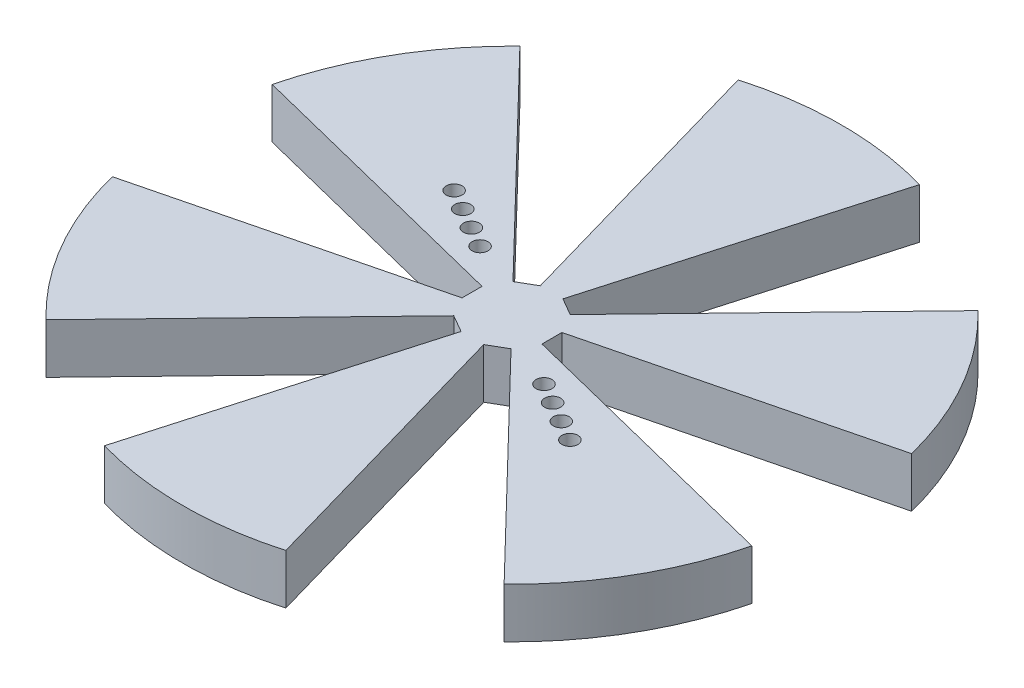
ISO-10303-21;
HEADER;
FILE_DESCRIPTION(('STEP AP214'),'2;1');
FILE_NAME('part.step','',(''),(''),'','','');
FILE_SCHEMA(('AUTOMOTIVE_DESIGN { 1 0 10303 214 1 1 1 1 }'));
ENDSEC;
DATA;
#1=APPLICATION_CONTEXT('core data for automotive mechanical design processes');
#2=APPLICATION_PROTOCOL_DEFINITION('international standard','automotive_design',2000,#1);
#3=PRODUCT_CONTEXT('',#1,'mechanical');
#4=PRODUCT('Part','Part','',(#3));
#5=PRODUCT_RELATED_PRODUCT_CATEGORY('part','',(#4));
#6=PRODUCT_DEFINITION_FORMATION('','',#4);
#7=PRODUCT_DEFINITION_CONTEXT('part definition',#1,'design');
#8=PRODUCT_DEFINITION('design','',#6,#7);
#9=PRODUCT_DEFINITION_SHAPE('','',#8);
#10=(LENGTH_UNIT() NAMED_UNIT(*) SI_UNIT(.MILLI.,.METRE.));
#11=(NAMED_UNIT(*) PLANE_ANGLE_UNIT() SI_UNIT($,.RADIAN.));
#12=(NAMED_UNIT(*) SI_UNIT($,.STERADIAN.) SOLID_ANGLE_UNIT());
#13=UNCERTAINTY_MEASURE_WITH_UNIT(LENGTH_MEASURE(1.E-05),#10,'distance_accuracy_value','');
#14=(GEOMETRIC_REPRESENTATION_CONTEXT(3) GLOBAL_UNCERTAINTY_ASSIGNED_CONTEXT((#13)) GLOBAL_UNIT_ASSIGNED_CONTEXT((#10,
#11,#12)) REPRESENTATION_CONTEXT('',''));
#15=CARTESIAN_POINT('',(0.,0.,0.));
#16=DIRECTION('',(0.,0.,1.));
#17=DIRECTION('',(1.,0.,0.));
#18=AXIS2_PLACEMENT_3D('',#15,#16,#17);
#19=CARTESIAN_POINT('',(0.,6.35,0.));
#20=DIRECTION('',(0.,-1.,0.));
#21=DIRECTION('',(0.,0.,-1.));
#22=AXIS2_PLACEMENT_3D('',#19,#20,#21);
#23=CYLINDRICAL_SURFACE('',#22,41.91);
#24=DIRECTION('',(0.,1.,0.));
#25=VECTOR('',#24,1.);
#26=CARTESIAN_POINT('',(-11.5311013513994,0.,40.2924534078499));
#27=LINE('',#26,#25);
#28=CARTESIAN_POINT('',(-11.5311013513994,0.,40.2924534078499));
#29=VERTEX_POINT('',#28);
#30=CARTESIAN_POINT('',(-11.5311013513994,6.35,40.2924534078499));
#31=VERTEX_POINT('',#30);
#32=EDGE_CURVE('E319',#29,#31,#27,.T.);
#33=ORIENTED_EDGE('',*,*,#32,.F.);
#34=CARTESIAN_POINT('',(0.,0.,0.));
#35=DIRECTION('',(0.,1.,0.));
#36=DIRECTION('',(0.,0.,1.));
#37=AXIS2_PLACEMENT_3D('',#34,#35,#36);
#38=CIRCLE('',#37,41.91);
#39=CARTESIAN_POINT('',(11.5311013513994,0.,40.2924534078499));
#40=VERTEX_POINT('',#39);
#41=EDGE_CURVE('E312',#29,#40,#38,.T.);
#42=ORIENTED_EDGE('',*,*,#41,.T.);
#43=DIRECTION('',(0.,1.,0.));
#44=VECTOR('',#43,1.);
#45=CARTESIAN_POINT('',(11.5311013513994,0.,40.2924534078499));
#46=LINE('',#45,#44);
#47=CARTESIAN_POINT('',(11.5311013513994,6.35,40.2924534078499));
#48=VERTEX_POINT('',#47);
#49=EDGE_CURVE('E292',#40,#48,#46,.T.);
#50=ORIENTED_EDGE('',*,*,#49,.T.);
#51=CARTESIAN_POINT('',(0.,6.35,0.));
#52=DIRECTION('',(0.,1.,0.));
#53=DIRECTION('',(0.,0.,1.));
#54=AXIS2_PLACEMENT_3D('',#51,#52,#53);
#55=CIRCLE('',#54,41.91);
#56=EDGE_CURVE('E613',#31,#48,#55,.T.);
#57=ORIENTED_EDGE('',*,*,#56,.F.);
#58=EDGE_LOOP('',(#33,#42,#50,#57));
#59=FACE_BOUND('',#58,.T.);
#60=ADVANCED_FACE('F129',(#59),#23,.T.);
#61=DIRECTION('',(0.,1.,0.));
#62=VECTOR('',#61,1.);
#63=CARTESIAN_POINT('',(-29.1287375562992,0.,30.1324534078499));
#64=LINE('',#63,#62);
#65=CARTESIAN_POINT('',(-29.1287375562992,0.,30.1324534078499));
#66=VERTEX_POINT('',#65);
#67=CARTESIAN_POINT('',(-29.1287375562992,6.35,30.1324534078499));
#68=VERTEX_POINT('',#67);
#69=EDGE_CURVE('E432',#66,#68,#64,.T.);
#70=ORIENTED_EDGE('',*,*,#69,.T.);
#71=CARTESIAN_POINT('',(-40.6598389076986,6.35,10.16));
#72=VERTEX_POINT('',#71);
#73=EDGE_CURVE('E137',#72,#68,#55,.T.);
#74=ORIENTED_EDGE('',*,*,#73,.F.);
#75=DIRECTION('',(0.,1.,0.));
#76=VECTOR('',#75,1.);
#77=CARTESIAN_POINT('',(-40.6598389076986,0.,10.16));
#78=LINE('',#77,#76);
#79=CARTESIAN_POINT('',(-40.6598389076986,0.,10.16));
#80=VERTEX_POINT('',#79);
#81=EDGE_CURVE('E445',#80,#72,#78,.T.);
#82=ORIENTED_EDGE('',*,*,#81,.F.);
#83=EDGE_CURVE('E320',#80,#66,#38,.T.);
#84=ORIENTED_EDGE('',*,*,#83,.T.);
#85=EDGE_LOOP('',(#70,#74,#82,#84));
#86=FACE_BOUND('',#85,.T.);
#87=ADVANCED_FACE('F560',(#86),#23,.T.);
#88=DIRECTION('',(0.,1.,0.));
#89=VECTOR('',#88,1.);
#90=CARTESIAN_POINT('',(-40.6598389076986,0.,-10.16));
#91=LINE('',#90,#89);
#92=CARTESIAN_POINT('',(-40.6598389076986,0.,-10.16));
#93=VERTEX_POINT('',#92);
#94=CARTESIAN_POINT('',(-40.6598389076986,6.35,-10.16));
#95=VERTEX_POINT('',#94);
#96=EDGE_CURVE('E455',#93,#95,#91,.T.);
#97=ORIENTED_EDGE('',*,*,#96,.T.);
#98=CARTESIAN_POINT('',(-29.1287375562992,6.35,-30.1324534078499));
#99=VERTEX_POINT('',#98);
#100=EDGE_CURVE('E12',#99,#95,#55,.T.);
#101=ORIENTED_EDGE('',*,*,#100,.F.);
#102=DIRECTION('',(0.,1.,0.));
#103=VECTOR('',#102,1.);
#104=CARTESIAN_POINT('',(-29.1287375562992,0.,-30.1324534078499));
#105=LINE('',#104,#103);
#106=CARTESIAN_POINT('',(-29.1287375562992,0.,-30.1324534078499));
#107=VERTEX_POINT('',#106);
#108=EDGE_CURVE('E335',#107,#99,#105,.T.);
#109=ORIENTED_EDGE('',*,*,#108,.F.);
#110=EDGE_CURVE('E132',#107,#93,#38,.T.);
#111=ORIENTED_EDGE('',*,*,#110,.T.);
#112=EDGE_LOOP('',(#97,#101,#109,#111));
#113=FACE_BOUND('',#112,.T.);
#114=ADVANCED_FACE('F572',(#113),#23,.T.);
#115=DIRECTION('',(0.,1.,0.));
#116=VECTOR('',#115,1.);
#117=CARTESIAN_POINT('',(29.1287375562992,0.,30.1324534078499));
#118=LINE('',#117,#116);
#119=CARTESIAN_POINT('',(29.1287375562992,0.,30.1324534078499));
#120=VERTEX_POINT('',#119);
#121=CARTESIAN_POINT('',(29.1287375562992,6.35,30.1324534078499));
#122=VERTEX_POINT('',#121);
#123=EDGE_CURVE('E304',#120,#122,#118,.T.);
#124=ORIENTED_EDGE('',*,*,#123,.F.);
#125=CARTESIAN_POINT('',(40.6598389076986,0.,10.16));
#126=VERTEX_POINT('',#125);
#127=EDGE_CURVE('E321',#120,#126,#38,.T.);
#128=ORIENTED_EDGE('',*,*,#127,.T.);
#129=DIRECTION('',(0.,1.,0.));
#130=VECTOR('',#129,1.);
#131=CARTESIAN_POINT('',(40.6598389076986,0.,10.16));
#132=LINE('',#131,#130);
#133=CARTESIAN_POINT('',(40.6598389076986,6.35,10.16));
#134=VERTEX_POINT('',#133);
#135=EDGE_CURVE('E408',#126,#134,#132,.T.);
#136=ORIENTED_EDGE('',*,*,#135,.T.);
#137=EDGE_CURVE('E355',#122,#134,#55,.T.);
#138=ORIENTED_EDGE('',*,*,#137,.F.);
#139=EDGE_LOOP('',(#124,#128,#136,#138));
#140=FACE_BOUND('',#139,.T.);
#141=ADVANCED_FACE('F612',(#140),#23,.T.);
#142=DIRECTION('',(0.,1.,0.));
#143=VECTOR('',#142,1.);
#144=CARTESIAN_POINT('',(11.5311013513994,0.,-40.2924534078499));
#145=LINE('',#144,#143);
#146=CARTESIAN_POINT('',(11.5311013513994,0.,-40.2924534078499));
#147=VERTEX_POINT('',#146);
#148=CARTESIAN_POINT('',(11.5311013513994,6.35,-40.2924534078499));
#149=VERTEX_POINT('',#148);
#150=EDGE_CURVE('E372',#147,#149,#145,.T.);
#151=ORIENTED_EDGE('',*,*,#150,.F.);
#152=CARTESIAN_POINT('',(-11.5311013513994,0.,-40.2924534078499));
#153=VERTEX_POINT('',#152);
#154=EDGE_CURVE('E330',#147,#153,#38,.T.);
#155=ORIENTED_EDGE('',*,*,#154,.T.);
#156=DIRECTION('',(0.,1.,0.));
#157=VECTOR('',#156,1.);
#158=CARTESIAN_POINT('',(-11.5311013513994,0.,-40.2924534078499));
#159=LINE('',#158,#157);
#160=CARTESIAN_POINT('',(-11.5311013513994,6.35,-40.2924534078499));
#161=VERTEX_POINT('',#160);
#162=EDGE_CURVE('E341',#153,#161,#159,.T.);
#163=ORIENTED_EDGE('',*,*,#162,.T.);
#164=EDGE_CURVE('E138',#149,#161,#55,.T.);
#165=ORIENTED_EDGE('',*,*,#164,.F.);
#166=EDGE_LOOP('',(#151,#155,#163,#165));
#167=FACE_BOUND('',#166,.T.);
#168=ADVANCED_FACE('F583',(#167),#23,.T.);
#169=DIRECTION('',(0.,1.,0.));
#170=VECTOR('',#169,1.);
#171=CARTESIAN_POINT('',(29.1287375562992,0.,-30.1324534078499));
#172=LINE('',#171,#170);
#173=CARTESIAN_POINT('',(29.1287375562992,0.,-30.1324534078499));
#174=VERTEX_POINT('',#173);
#175=CARTESIAN_POINT('',(29.1287375562992,6.35,-30.1324534078499));
#176=VERTEX_POINT('',#175);
#177=EDGE_CURVE('E384',#174,#176,#172,.T.);
#178=ORIENTED_EDGE('',*,*,#177,.T.);
#179=CARTESIAN_POINT('',(40.6598389076986,6.35,-10.16));
#180=VERTEX_POINT('',#179);
#181=EDGE_CURVE('E348',#180,#176,#55,.T.);
#182=ORIENTED_EDGE('',*,*,#181,.F.);
#183=DIRECTION('',(0.,1.,0.));
#184=VECTOR('',#183,1.);
#185=CARTESIAN_POINT('',(40.6598389076986,0.,-10.16));
#186=LINE('',#185,#184);
#187=CARTESIAN_POINT('',(40.6598389076986,0.,-10.16));
#188=VERTEX_POINT('',#187);
#189=EDGE_CURVE('E396',#188,#180,#186,.T.);
#190=ORIENTED_EDGE('',*,*,#189,.F.);
#191=EDGE_CURVE('E324',#188,#174,#38,.T.);
#192=ORIENTED_EDGE('',*,*,#191,.T.);
#193=EDGE_LOOP('',(#178,#182,#190,#192));
#194=FACE_BOUND('',#193,.T.);
#195=ADVANCED_FACE('F538',(#194),#23,.T.);
#196=CARTESIAN_POINT('',(0.,6.35,0.));
#197=DIRECTION('',(0.,1.,0.));
#198=DIRECTION('',(0.,0.,1.));
#199=AXIS2_PLACEMENT_3D('',#196,#197,#198);
#200=PLANE('',#199);
#201=CARTESIAN_POINT('',(-14.8198597222612,6.35,-8.55624999999999));
#202=DIRECTION('',(0.,1.,0.));
#203=DIRECTION('',(0.,0.,1.));
#204=AXIS2_PLACEMENT_3D('',#201,#202,#203);
#205=CIRCLE('',#204,1.016);
#206=CARTESIAN_POINT('',(-14.8198597222612,6.35,-7.54024999999999));
#207=VERTEX_POINT('',#206);
#208=EDGE_CURVE('E495',#207,#207,#205,.T.);
#209=ORIENTED_EDGE('',*,*,#208,.F.);
#210=EDGE_LOOP('',(#209));
#211=FACE_BOUND('',#210,.T.);
#212=CARTESIAN_POINT('',(-17.4179359336145,6.35,-10.05625));
#213=DIRECTION('',(0.,1.,0.));
#214=DIRECTION('',(0.,0.,1.));
#215=AXIS2_PLACEMENT_3D('',#212,#213,#214);
#216=CIRCLE('',#215,1.016);
#217=CARTESIAN_POINT('',(-17.4179359336145,6.35,-9.04024999999999));
#218=VERTEX_POINT('',#217);
#219=EDGE_CURVE('E513',#218,#218,#216,.T.);
#220=ORIENTED_EDGE('',*,*,#219,.F.);
#221=EDGE_LOOP('',(#220));
#222=FACE_BOUND('',#221,.T.);
#223=CARTESIAN_POINT('',(-12.2217835109079,6.35,-7.05624999999999));
#224=DIRECTION('',(0.,1.,0.));
#225=DIRECTION('',(0.,0.,1.));
#226=AXIS2_PLACEMENT_3D('',#223,#224,#225);
#227=CIRCLE('',#226,1.016);
#228=CARTESIAN_POINT('',(-12.2217835109079,6.35,-6.04024999999999));
#229=VERTEX_POINT('',#228);
#230=EDGE_CURVE('E506',#229,#229,#227,.T.);
#231=ORIENTED_EDGE('',*,*,#230,.F.);
#232=EDGE_LOOP('',(#231));
#233=FACE_BOUND('',#232,.T.);
#234=CARTESIAN_POINT('',(12.2217835109079,6.35,7.05625));
#235=DIRECTION('',(0.,1.,0.));
#236=DIRECTION('',(0.,0.,1.));
#237=AXIS2_PLACEMENT_3D('',#234,#235,#236);
#238=CIRCLE('',#237,1.016);
#239=CARTESIAN_POINT('',(12.2217835109079,6.35,8.07225));
#240=VERTEX_POINT('',#239);
#241=EDGE_CURVE('E507',#240,#240,#238,.T.);
#242=ORIENTED_EDGE('',*,*,#241,.F.);
#243=EDGE_LOOP('',(#242));
#244=FACE_BOUND('',#243,.T.);
#245=CARTESIAN_POINT('',(14.8198597222612,6.35,8.55624999999999));
#246=DIRECTION('',(0.,1.,0.));
#247=DIRECTION('',(0.,0.,1.));
#248=AXIS2_PLACEMENT_3D('',#245,#246,#247);
#249=CIRCLE('',#248,1.01600000000001);
#250=CARTESIAN_POINT('',(14.8198597222612,6.35,9.57225));
#251=VERTEX_POINT('',#250);
#252=EDGE_CURVE('E524',#251,#251,#249,.T.);
#253=ORIENTED_EDGE('',*,*,#252,.F.);
#254=EDGE_LOOP('',(#253));
#255=FACE_BOUND('',#254,.T.);
#256=CARTESIAN_POINT('',(9.62370729955458,6.35,5.55624999999999));
#257=DIRECTION('',(0.,1.,0.));
#258=DIRECTION('',(0.,0.,1.));
#259=AXIS2_PLACEMENT_3D('',#256,#257,#258);
#260=CIRCLE('',#259,1.016);
#261=CARTESIAN_POINT('',(9.62370729955458,6.35,6.57224999999999));
#262=VERTEX_POINT('',#261);
#263=EDGE_CURVE('E494',#262,#262,#260,.T.);
#264=ORIENTED_EDGE('',*,*,#263,.F.);
#265=EDGE_LOOP('',(#264));
#266=FACE_BOUND('',#265,.T.);
#267=CARTESIAN_POINT('',(-9.62370729955458,6.35,-5.55624999999999));
#268=DIRECTION('',(0.,1.,0.));
#269=DIRECTION('',(0.,0.,1.));
#270=AXIS2_PLACEMENT_3D('',#267,#268,#269);
#271=CIRCLE('',#270,1.016);
#272=CARTESIAN_POINT('',(-9.62370729955458,6.35,-4.54024999999999));
#273=VERTEX_POINT('',#272);
#274=EDGE_CURVE('E488',#273,#273,#271,.T.);
#275=ORIENTED_EDGE('',*,*,#274,.F.);
#276=EDGE_LOOP('',(#275));
#277=FACE_BOUND('',#276,.T.);
#278=CARTESIAN_POINT('',(17.4179359336145,6.35,10.05625));
#279=DIRECTION('',(0.,1.,0.));
#280=DIRECTION('',(0.,0.,1.));
#281=AXIS2_PLACEMENT_3D('',#278,#279,#280);
#282=CIRCLE('',#281,1.016);
#283=CARTESIAN_POINT('',(17.4179359336145,6.35,11.07225));
#284=VERTEX_POINT('',#283);
#285=EDGE_CURVE('E485',#284,#284,#282,.T.);
#286=ORIENTED_EDGE('',*,*,#285,.F.);
#287=EDGE_LOOP('',(#286));
#288=FACE_BOUND('',#287,.T.);
#289=DIRECTION('',(-0.866025403784439,0.,-0.5));
#290=VECTOR('',#289,1.);
#291=CARTESIAN_POINT('',(-2.54,6.35,4.39940905122495));
#292=LINE('',#291,#290);
#293=CARTESIAN_POINT('',(-1.44068438141347,6.35,5.03409921954024));
#294=VERTEX_POINT('',#293);
#295=CARTESIAN_POINT('',(-3.63931561858654,6.35,3.76471888290965));
#296=VERTEX_POINT('',#295);
#297=EDGE_CURVE('E440',#294,#296,#292,.T.);
#298=ORIENTED_EDGE('',*,*,#297,.F.);
#299=DIRECTION('',(-0.275139617069897,0.,0.961404280788592));
#300=VECTOR('',#299,1.);
#301=CARTESIAN_POINT('',(0.,6.35,0.));
#302=LINE('',#301,#300);
#303=EDGE_CURVE('E442',#294,#31,#302,.T.);
#304=ORIENTED_EDGE('',*,*,#303,.T.);
#305=ORIENTED_EDGE('',*,*,#56,.T.);
#306=DIRECTION('',(-0.275139617069897,0.,-0.961404280788592));
#307=VECTOR('',#306,1.);
#308=CARTESIAN_POINT('',(0.,6.35,0.));
#309=LINE('',#308,#307);
#310=CARTESIAN_POINT('',(1.44068438141347,6.35,5.03409921954024));
#311=VERTEX_POINT('',#310);
#312=EDGE_CURVE('E299',#48,#311,#309,.T.);
#313=ORIENTED_EDGE('',*,*,#312,.T.);
#314=DIRECTION('',(0.866025403784439,0.,-0.5));
#315=VECTOR('',#314,1.);
#316=CARTESIAN_POINT('',(2.54,6.35,4.39940905122495));
#317=LINE('',#316,#315);
#318=CARTESIAN_POINT('',(3.63931561858653,6.35,3.76471888290965));
#319=VERTEX_POINT('',#318);
#320=EDGE_CURVE('E316',#311,#319,#317,.T.);
#321=ORIENTED_EDGE('',*,*,#320,.T.);
#322=DIRECTION('',(0.69503072193508,0.,0.71898003836435));
#323=VECTOR('',#322,1.);
#324=CARTESIAN_POINT('',(0.,6.35,0.));
#325=LINE('',#324,#323);
#326=EDGE_CURVE('E479',#319,#122,#325,.T.);
#327=ORIENTED_EDGE('',*,*,#326,.T.);
#328=ORIENTED_EDGE('',*,*,#137,.T.);
#329=DIRECTION('',(-0.970170339004977,0.,-0.242424242424242));
#330=VECTOR('',#329,1.);
#331=CARTESIAN_POINT('',(0.,6.35,0.));
#332=LINE('',#331,#330);
#333=CARTESIAN_POINT('',(5.08,6.35,1.26938033663059));
#334=VERTEX_POINT('',#333);
#335=EDGE_CURVE('E411',#134,#334,#332,.T.);
#336=ORIENTED_EDGE('',*,*,#335,.T.);
#337=DIRECTION('',(0.,0.,1.));
#338=VECTOR('',#337,1.);
#339=CARTESIAN_POINT('',(5.08,6.35,0.));
#340=LINE('',#339,#338);
#341=CARTESIAN_POINT('',(5.08,6.35,-1.26938033663059));
#342=VERTEX_POINT('',#341);
#343=EDGE_CURVE('E415',#342,#334,#340,.T.);
#344=ORIENTED_EDGE('',*,*,#343,.F.);
#345=DIRECTION('',(0.970170339004977,0.,-0.242424242424242));
#346=VECTOR('',#345,1.);
#347=CARTESIAN_POINT('',(0.,6.35,0.));
#348=LINE('',#347,#346);
#349=EDGE_CURVE('E418',#342,#180,#348,.T.);
#350=ORIENTED_EDGE('',*,*,#349,.T.);
#351=ORIENTED_EDGE('',*,*,#181,.T.);
#352=DIRECTION('',(-0.695030721935079,0.,0.71898003836435));
#353=VECTOR('',#352,1.);
#354=CARTESIAN_POINT('',(0.,6.35,0.));
#355=LINE('',#354,#353);
#356=CARTESIAN_POINT('',(3.63931561858653,6.35,-3.76471888290966));
#357=VERTEX_POINT('',#356);
#358=EDGE_CURVE('E387',#176,#357,#355,.T.);
#359=ORIENTED_EDGE('',*,*,#358,.T.);
#360=DIRECTION('',(0.866025403784439,0.,0.499999999999999));
#361=VECTOR('',#360,1.);
#362=CARTESIAN_POINT('',(2.54,6.35,-4.39940905122495));
#363=LINE('',#362,#361);
#364=CARTESIAN_POINT('',(1.44068438141346,6.35,-5.03409921954024));
#365=VERTEX_POINT('',#364);
#366=EDGE_CURVE('E391',#365,#357,#363,.T.);
#367=ORIENTED_EDGE('',*,*,#366,.F.);
#368=DIRECTION('',(0.275139617069897,0.,-0.961404280788593));
#369=VECTOR('',#368,1.);
#370=CARTESIAN_POINT('',(0.,6.35,0.));
#371=LINE('',#370,#369);
#372=EDGE_CURVE('E394',#365,#149,#371,.T.);
#373=ORIENTED_EDGE('',*,*,#372,.T.);
#374=ORIENTED_EDGE('',*,*,#164,.T.);
#375=DIRECTION('',(0.275139617069898,0.,0.961404280788592));
#376=VECTOR('',#375,1.);
#377=CARTESIAN_POINT('',(0.,6.35,0.));
#378=LINE('',#377,#376);
#379=CARTESIAN_POINT('',(-1.44068438141347,6.35,-5.03409921954024));
#380=VERTEX_POINT('',#379);
#381=EDGE_CURVE('E363',#161,#380,#378,.T.);
#382=ORIENTED_EDGE('',*,*,#381,.T.);
#383=DIRECTION('',(0.866025403784438,0.,-0.500000000000001));
#384=VECTOR('',#383,1.);
#385=CARTESIAN_POINT('',(-2.54,6.35,-4.39940905122495));
#386=LINE('',#385,#384);
#387=CARTESIAN_POINT('',(-3.63931561858654,6.35,-3.76471888290965));
#388=VERTEX_POINT('',#387);
#389=EDGE_CURVE('E366',#388,#380,#386,.T.);
#390=ORIENTED_EDGE('',*,*,#389,.F.);
#391=DIRECTION('',(-0.69503072193508,0.,-0.718980038364349));
#392=VECTOR('',#391,1.);
#393=CARTESIAN_POINT('',(0.,6.35,0.));
#394=LINE('',#393,#392);
#395=EDGE_CURVE('E369',#388,#99,#394,.T.);
#396=ORIENTED_EDGE('',*,*,#395,.T.);
#397=ORIENTED_EDGE('',*,*,#100,.T.);
#398=DIRECTION('',(0.970170339004977,0.,0.242424242424243));
#399=VECTOR('',#398,1.);
#400=CARTESIAN_POINT('',(0.,6.35,0.));
#401=LINE('',#400,#399);
#402=CARTESIAN_POINT('',(-5.08,6.35,-1.26938033663059));
#403=VERTEX_POINT('',#402);
#404=EDGE_CURVE('E458',#95,#403,#401,.T.);
#405=ORIENTED_EDGE('',*,*,#404,.T.);
#406=DIRECTION('',(0.,0.,-1.));
#407=VECTOR('',#406,1.);
#408=CARTESIAN_POINT('',(-5.08,6.35,0.));
#409=LINE('',#408,#407);
#410=CARTESIAN_POINT('',(-5.08,6.35,1.26938033663059));
#411=VERTEX_POINT('',#410);
#412=EDGE_CURVE('E462',#411,#403,#409,.T.);
#413=ORIENTED_EDGE('',*,*,#412,.F.);
#414=DIRECTION('',(-0.970170339004977,0.,0.242424242424243));
#415=VECTOR('',#414,1.);
#416=CARTESIAN_POINT('',(0.,6.35,0.));
#417=LINE('',#416,#415);
#418=EDGE_CURVE('E464',#411,#72,#417,.T.);
#419=ORIENTED_EDGE('',*,*,#418,.T.);
#420=ORIENTED_EDGE('',*,*,#73,.T.);
#421=DIRECTION('',(0.69503072193508,0.,-0.71898003836435));
#422=VECTOR('',#421,1.);
#423=CARTESIAN_POINT('',(0.,6.35,0.));
#424=LINE('',#423,#422);
#425=EDGE_CURVE('E436',#68,#296,#424,.T.);
#426=ORIENTED_EDGE('',*,*,#425,.T.);
#427=EDGE_LOOP('',(#298,#304,#305,#313,#321,#327,#328,#336,#344,#350,#351,#359,#367,#373,#374,
#382,#390,#396,#397,#405,#413,#419,#420,#426));
#428=FACE_BOUND('',#427,.T.);
#429=ADVANCED_FACE('F535',(#211,#222,#233,#244,#255,#266,#277,#288,#428),#200,.T.);
#430=CARTESIAN_POINT('',(0.,0.,0.));
#431=DIRECTION('',(0.,1.,0.));
#432=DIRECTION('',(0.,0.,1.));
#433=AXIS2_PLACEMENT_3D('',#430,#431,#432);
#434=PLANE('',#433);
#435=CARTESIAN_POINT('',(-14.8198597222612,0.,-8.55624999999999));
#436=DIRECTION('',(0.,1.,0.));
#437=DIRECTION('',(0.,0.,1.));
#438=AXIS2_PLACEMENT_3D('',#435,#436,#437);
#439=CIRCLE('',#438,1.016);
#440=CARTESIAN_POINT('',(-14.8198597222612,0.,-7.54024999999999));
#441=VERTEX_POINT('',#440);
#442=EDGE_CURVE('E516',#441,#441,#439,.T.);
#443=ORIENTED_EDGE('',*,*,#442,.T.);
#444=EDGE_LOOP('',(#443));
#445=FACE_BOUND('',#444,.T.);
#446=CARTESIAN_POINT('',(-17.4179359336145,0.,-10.05625));
#447=DIRECTION('',(0.,1.,0.));
#448=DIRECTION('',(0.,0.,1.));
#449=AXIS2_PLACEMENT_3D('',#446,#447,#448);
#450=CIRCLE('',#449,1.016);
#451=CARTESIAN_POINT('',(-17.4179359336145,0.,-9.04024999999999));
#452=VERTEX_POINT('',#451);
#453=EDGE_CURVE('E510',#452,#452,#450,.T.);
#454=ORIENTED_EDGE('',*,*,#453,.T.);
#455=EDGE_LOOP('',(#454));
#456=FACE_BOUND('',#455,.T.);
#457=CARTESIAN_POINT('',(-12.2217835109079,0.,-7.05624999999999));
#458=DIRECTION('',(0.,1.,0.));
#459=DIRECTION('',(0.,0.,1.));
#460=AXIS2_PLACEMENT_3D('',#457,#458,#459);
#461=CIRCLE('',#460,1.016);
#462=CARTESIAN_POINT('',(-12.2217835109079,0.,-6.04024999999999));
#463=VERTEX_POINT('',#462);
#464=EDGE_CURVE('E503',#463,#463,#461,.T.);
#465=ORIENTED_EDGE('',*,*,#464,.T.);
#466=EDGE_LOOP('',(#465));
#467=FACE_BOUND('',#466,.T.);
#468=CARTESIAN_POINT('',(12.2217835109079,0.,7.05625));
#469=DIRECTION('',(0.,1.,0.));
#470=DIRECTION('',(0.,0.,1.));
#471=AXIS2_PLACEMENT_3D('',#468,#469,#470);
#472=CIRCLE('',#471,1.016);
#473=CARTESIAN_POINT('',(12.2217835109079,0.,8.07225));
#474=VERTEX_POINT('',#473);
#475=EDGE_CURVE('E527',#474,#474,#472,.T.);
#476=ORIENTED_EDGE('',*,*,#475,.T.);
#477=EDGE_LOOP('',(#476));
#478=FACE_BOUND('',#477,.T.);
#479=CARTESIAN_POINT('',(14.8198597222612,0.,8.55624999999999));
#480=DIRECTION('',(0.,1.,0.));
#481=DIRECTION('',(0.,0.,1.));
#482=AXIS2_PLACEMENT_3D('',#479,#480,#481);
#483=CIRCLE('',#482,1.01600000000001);
#484=CARTESIAN_POINT('',(14.8198597222612,0.,9.57225));
#485=VERTEX_POINT('',#484);
#486=EDGE_CURVE('E521',#485,#485,#483,.T.);
#487=ORIENTED_EDGE('',*,*,#486,.T.);
#488=EDGE_LOOP('',(#487));
#489=FACE_BOUND('',#488,.T.);
#490=CARTESIAN_POINT('',(9.62370729955458,0.,5.55624999999999));
#491=DIRECTION('',(0.,1.,0.));
#492=DIRECTION('',(0.,0.,1.));
#493=AXIS2_PLACEMENT_3D('',#490,#491,#492);
#494=CIRCLE('',#493,1.016);
#495=CARTESIAN_POINT('',(9.62370729955458,0.,6.57224999999999));
#496=VERTEX_POINT('',#495);
#497=EDGE_CURVE('E491',#496,#496,#494,.T.);
#498=ORIENTED_EDGE('',*,*,#497,.T.);
#499=EDGE_LOOP('',(#498));
#500=FACE_BOUND('',#499,.T.);
#501=CARTESIAN_POINT('',(-9.62370729955458,0.,-5.55624999999999));
#502=DIRECTION('',(0.,1.,0.));
#503=DIRECTION('',(0.,0.,1.));
#504=AXIS2_PLACEMENT_3D('',#501,#502,#503);
#505=CIRCLE('',#504,1.016);
#506=CARTESIAN_POINT('',(-9.62370729955458,0.,-4.54024999999999));
#507=VERTEX_POINT('',#506);
#508=EDGE_CURVE('E498',#507,#507,#505,.T.);
#509=ORIENTED_EDGE('',*,*,#508,.T.);
#510=EDGE_LOOP('',(#509));
#511=FACE_BOUND('',#510,.T.);
#512=CARTESIAN_POINT('',(17.4179359336145,0.,10.05625));
#513=DIRECTION('',(0.,1.,0.));
#514=DIRECTION('',(0.,0.,1.));
#515=AXIS2_PLACEMENT_3D('',#512,#513,#514);
#516=CIRCLE('',#515,1.016);
#517=CARTESIAN_POINT('',(17.4179359336145,0.,11.07225));
#518=VERTEX_POINT('',#517);
#519=EDGE_CURVE('E467',#518,#518,#516,.T.);
#520=ORIENTED_EDGE('',*,*,#519,.T.);
#521=EDGE_LOOP('',(#520));
#522=FACE_BOUND('',#521,.T.);
#523=DIRECTION('',(-0.275139617069897,0.,0.961404280788592));
#524=VECTOR('',#523,1.);
#525=CARTESIAN_POINT('',(0.,0.,0.));
#526=LINE('',#525,#524);
#527=CARTESIAN_POINT('',(-1.44068438141347,0.,5.03409921954024));
#528=VERTEX_POINT('',#527);
#529=EDGE_CURVE('E439',#528,#29,#526,.T.);
#530=ORIENTED_EDGE('',*,*,#529,.F.);
#531=DIRECTION('',(-0.866025403784439,0.,-0.5));
#532=VECTOR('',#531,1.);
#533=CARTESIAN_POINT('',(-2.54,0.,4.39940905122495));
#534=LINE('',#533,#532);
#535=CARTESIAN_POINT('',(-3.63931561858654,0.,3.76471888290965));
#536=VERTEX_POINT('',#535);
#537=EDGE_CURVE('E447',#528,#536,#534,.T.);
#538=ORIENTED_EDGE('',*,*,#537,.T.);
#539=DIRECTION('',(0.69503072193508,0.,-0.71898003836435));
#540=VECTOR('',#539,1.);
#541=CARTESIAN_POINT('',(0.,0.,0.));
#542=LINE('',#541,#540);
#543=EDGE_CURVE('E430',#66,#536,#542,.T.);
#544=ORIENTED_EDGE('',*,*,#543,.F.);
#545=ORIENTED_EDGE('',*,*,#83,.F.);
#546=DIRECTION('',(-0.970170339004977,0.,0.242424242424243));
#547=VECTOR('',#546,1.);
#548=CARTESIAN_POINT('',(0.,0.,0.));
#549=LINE('',#548,#547);
#550=CARTESIAN_POINT('',(-5.08,0.,1.26938033663059));
#551=VERTEX_POINT('',#550);
#552=EDGE_CURVE('E461',#551,#80,#549,.T.);
#553=ORIENTED_EDGE('',*,*,#552,.F.);
#554=DIRECTION('',(0.,0.,-1.));
#555=VECTOR('',#554,1.);
#556=CARTESIAN_POINT('',(-5.08,0.,0.));
#557=LINE('',#556,#555);
#558=CARTESIAN_POINT('',(-5.08,0.,-1.26938033663059));
#559=VERTEX_POINT('',#558);
#560=EDGE_CURVE('E469',#551,#559,#557,.T.);
#561=ORIENTED_EDGE('',*,*,#560,.T.);
#562=DIRECTION('',(0.970170339004977,0.,0.242424242424243));
#563=VECTOR('',#562,1.);
#564=CARTESIAN_POINT('',(0.,0.,0.));
#565=LINE('',#564,#563);
#566=EDGE_CURVE('E453',#93,#559,#565,.T.);
#567=ORIENTED_EDGE('',*,*,#566,.F.);
#568=ORIENTED_EDGE('',*,*,#110,.F.);
#569=DIRECTION('',(-0.69503072193508,0.,-0.718980038364349));
#570=VECTOR('',#569,1.);
#571=CARTESIAN_POINT('',(0.,0.,0.));
#572=LINE('',#571,#570);
#573=CARTESIAN_POINT('',(-3.63931561858654,0.,-3.76471888290965));
#574=VERTEX_POINT('',#573);
#575=EDGE_CURVE('E365',#574,#107,#572,.T.);
#576=ORIENTED_EDGE('',*,*,#575,.F.);
#577=DIRECTION('',(0.866025403784438,0.,-0.500000000000001));
#578=VECTOR('',#577,1.);
#579=CARTESIAN_POINT('',(-2.54,0.,-4.39940905122495));
#580=LINE('',#579,#578);
#581=CARTESIAN_POINT('',(-1.44068438141347,0.,-5.03409921954024));
#582=VERTEX_POINT('',#581);
#583=EDGE_CURVE('E375',#574,#582,#580,.T.);
#584=ORIENTED_EDGE('',*,*,#583,.T.);
#585=DIRECTION('',(0.275139617069898,0.,0.961404280788592));
#586=VECTOR('',#585,1.);
#587=CARTESIAN_POINT('',(0.,0.,0.));
#588=LINE('',#587,#586);
#589=EDGE_CURVE('E360',#153,#582,#588,.T.);
#590=ORIENTED_EDGE('',*,*,#589,.F.);
#591=ORIENTED_EDGE('',*,*,#154,.F.);
#592=DIRECTION('',(0.275139617069897,0.,-0.961404280788593));
#593=VECTOR('',#592,1.);
#594=CARTESIAN_POINT('',(0.,0.,0.));
#595=LINE('',#594,#593);
#596=CARTESIAN_POINT('',(1.44068438141346,0.,-5.03409921954024));
#597=VERTEX_POINT('',#596);
#598=EDGE_CURVE('E390',#597,#147,#595,.T.);
#599=ORIENTED_EDGE('',*,*,#598,.F.);
#600=DIRECTION('',(0.866025403784439,0.,0.499999999999999));
#601=VECTOR('',#600,1.);
#602=CARTESIAN_POINT('',(2.54,0.,-4.39940905122495));
#603=LINE('',#602,#601);
#604=CARTESIAN_POINT('',(3.63931561858653,0.,-3.76471888290966));
#605=VERTEX_POINT('',#604);
#606=EDGE_CURVE('E399',#597,#605,#603,.T.);
#607=ORIENTED_EDGE('',*,*,#606,.T.);
#608=DIRECTION('',(-0.695030721935079,0.,0.71898003836435));
#609=VECTOR('',#608,1.);
#610=CARTESIAN_POINT('',(0.,0.,0.));
#611=LINE('',#610,#609);
#612=EDGE_CURVE('E382',#174,#605,#611,.T.);
#613=ORIENTED_EDGE('',*,*,#612,.F.);
#614=ORIENTED_EDGE('',*,*,#191,.F.);
#615=DIRECTION('',(0.970170339004977,0.,-0.242424242424242));
#616=VECTOR('',#615,1.);
#617=CARTESIAN_POINT('',(0.,0.,0.));
#618=LINE('',#617,#616);
#619=CARTESIAN_POINT('',(5.08,0.,-1.26938033663059));
#620=VERTEX_POINT('',#619);
#621=EDGE_CURVE('E414',#620,#188,#618,.T.);
#622=ORIENTED_EDGE('',*,*,#621,.F.);
#623=DIRECTION('',(0.,0.,1.));
#624=VECTOR('',#623,1.);
#625=CARTESIAN_POINT('',(5.08,0.,0.));
#626=LINE('',#625,#624);
#627=CARTESIAN_POINT('',(5.08,0.,1.26938033663059));
#628=VERTEX_POINT('',#627);
#629=EDGE_CURVE('E424',#620,#628,#626,.T.);
#630=ORIENTED_EDGE('',*,*,#629,.T.);
#631=DIRECTION('',(-0.970170339004977,0.,-0.242424242424242));
#632=VECTOR('',#631,1.);
#633=CARTESIAN_POINT('',(0.,0.,0.));
#634=LINE('',#633,#632);
#635=EDGE_CURVE('E406',#126,#628,#634,.T.);
#636=ORIENTED_EDGE('',*,*,#635,.F.);
#637=ORIENTED_EDGE('',*,*,#127,.F.);
#638=DIRECTION('',(0.69503072193508,0.,0.71898003836435));
#639=VECTOR('',#638,1.);
#640=CARTESIAN_POINT('',(0.,0.,0.));
#641=LINE('',#640,#639);
#642=CARTESIAN_POINT('',(3.63931561858653,0.,3.76471888290965));
#643=VERTEX_POINT('',#642);
#644=EDGE_CURVE('E315',#643,#120,#641,.T.);
#645=ORIENTED_EDGE('',*,*,#644,.F.);
#646=DIRECTION('',(0.866025403784439,0.,-0.5));
#647=VECTOR('',#646,1.);
#648=CARTESIAN_POINT('',(2.54,0.,4.39940905122495));
#649=LINE('',#648,#647);
#650=CARTESIAN_POINT('',(1.44068438141347,0.,5.03409921954024));
#651=VERTEX_POINT('',#650);
#652=EDGE_CURVE('E305',#651,#643,#649,.T.);
#653=ORIENTED_EDGE('',*,*,#652,.F.);
#654=DIRECTION('',(-0.275139617069897,0.,-0.961404280788592));
#655=VECTOR('',#654,1.);
#656=CARTESIAN_POINT('',(0.,0.,0.));
#657=LINE('',#656,#655);
#658=EDGE_CURVE('E296',#40,#651,#657,.T.);
#659=ORIENTED_EDGE('',*,*,#658,.F.);
#660=ORIENTED_EDGE('',*,*,#41,.F.);
#661=EDGE_LOOP('',(#530,#538,#544,#545,#553,#561,#567,#568,#576,#584,#590,#591,#599,#607,#613,
#614,#622,#630,#636,#637,#645,#653,#659,#660));
#662=FACE_BOUND('',#661,.T.);
#663=ADVANCED_FACE('F311',(#445,#456,#467,#478,#489,#500,#511,#522,#662),#434,.F.);
#664=CARTESIAN_POINT('',(0.,0.,0.));
#665=DIRECTION('',(0.718980038364349,0.,-0.69503072193508));
#666=DIRECTION('',(-0.69503072193508,0.,-0.718980038364349));
#667=AXIS2_PLACEMENT_3D('',#664,#665,#666);
#668=PLANE('',#667);
#669=ORIENTED_EDGE('',*,*,#395,.F.);
#670=DIRECTION('',(0.,1.,0.));
#671=VECTOR('',#670,1.);
#672=CARTESIAN_POINT('',(-3.63931561858654,0.,-3.76471888290965));
#673=LINE('',#672,#671);
#674=EDGE_CURVE('E357',#574,#388,#673,.T.);
#675=ORIENTED_EDGE('',*,*,#674,.F.);
#676=ORIENTED_EDGE('',*,*,#575,.T.);
#677=ORIENTED_EDGE('',*,*,#108,.T.);
#678=EDGE_LOOP('',(#669,#675,#676,#677));
#679=FACE_BOUND('',#678,.T.);
#680=ADVANCED_FACE('F576',(#679),#668,.T.);
#681=CARTESIAN_POINT('',(0.,0.,0.));
#682=DIRECTION('',(-0.961404280788592,0.,0.275139617069898));
#683=DIRECTION('',(0.275139617069898,0.,0.961404280788592));
#684=AXIS2_PLACEMENT_3D('',#681,#682,#683);
#685=PLANE('',#684);
#686=ORIENTED_EDGE('',*,*,#381,.F.);
#687=ORIENTED_EDGE('',*,*,#162,.F.);
#688=ORIENTED_EDGE('',*,*,#589,.T.);
#689=DIRECTION('',(0.,1.,0.));
#690=VECTOR('',#689,1.);
#691=CARTESIAN_POINT('',(-1.44068438141347,0.,-5.03409921954024));
#692=LINE('',#691,#690);
#693=EDGE_CURVE('E359',#582,#380,#692,.T.);
#694=ORIENTED_EDGE('',*,*,#693,.T.);
#695=EDGE_LOOP('',(#686,#687,#688,#694));
#696=FACE_BOUND('',#695,.T.);
#697=ADVANCED_FACE('F582',(#696),#685,.T.);
#698=CARTESIAN_POINT('',(-2.54,0.,-4.39940905122495));
#699=DIRECTION('',(0.500000000000001,0.,0.866025403784438));
#700=DIRECTION('',(0.866025403784438,0.,-0.500000000000001));
#701=AXIS2_PLACEMENT_3D('',#698,#699,#700);
#702=PLANE('',#701);
#703=ORIENTED_EDGE('',*,*,#389,.T.);
#704=ORIENTED_EDGE('',*,*,#693,.F.);
#705=ORIENTED_EDGE('',*,*,#583,.F.);
#706=ORIENTED_EDGE('',*,*,#674,.T.);
#707=EDGE_LOOP('',(#703,#704,#705,#706));
#708=FACE_BOUND('',#707,.T.);
#709=ADVANCED_FACE('F580',(#708),#702,.F.);
#710=CARTESIAN_POINT('',(0.,0.,0.));
#711=DIRECTION('',(0.242424242424242,0.,0.970170339004977));
#712=DIRECTION('',(0.970170339004977,0.,-0.242424242424242));
#713=AXIS2_PLACEMENT_3D('',#710,#711,#712);
#714=PLANE('',#713);
#715=ORIENTED_EDGE('',*,*,#349,.F.);
#716=DIRECTION('',(0.,1.,0.));
#717=VECTOR('',#716,1.);
#718=CARTESIAN_POINT('',(5.08,0.,-1.26938033663059));
#719=LINE('',#718,#717);
#720=EDGE_CURVE('E403',#620,#342,#719,.T.);
#721=ORIENTED_EDGE('',*,*,#720,.F.);
#722=ORIENTED_EDGE('',*,*,#621,.T.);
#723=ORIENTED_EDGE('',*,*,#189,.T.);
#724=EDGE_LOOP('',(#715,#721,#722,#723));
#725=FACE_BOUND('',#724,.T.);
#726=ADVANCED_FACE('F600',(#725),#714,.T.);
#727=CARTESIAN_POINT('',(0.,0.,0.));
#728=DIRECTION('',(0.242424242424242,0.,-0.970170339004977));
#729=DIRECTION('',(-0.970170339004977,0.,-0.242424242424242));
#730=AXIS2_PLACEMENT_3D('',#727,#728,#729);
#731=PLANE('',#730);
#732=ORIENTED_EDGE('',*,*,#335,.F.);
#733=ORIENTED_EDGE('',*,*,#135,.F.);
#734=ORIENTED_EDGE('',*,*,#635,.T.);
#735=DIRECTION('',(0.,1.,0.));
#736=VECTOR('',#735,1.);
#737=CARTESIAN_POINT('',(5.08,0.,1.26938033663059));
#738=LINE('',#737,#736);
#739=EDGE_CURVE('E405',#628,#334,#738,.T.);
#740=ORIENTED_EDGE('',*,*,#739,.T.);
#741=EDGE_LOOP('',(#732,#733,#734,#740));
#742=FACE_BOUND('',#741,.T.);
#743=ADVANCED_FACE('F607',(#742),#731,.T.);
#744=CARTESIAN_POINT('',(5.08,0.,0.));
#745=DIRECTION('',(-1.,0.,0.));
#746=DIRECTION('',(0.,0.,1.));
#747=AXIS2_PLACEMENT_3D('',#744,#745,#746);
#748=PLANE('',#747);
#749=ORIENTED_EDGE('',*,*,#343,.T.);
#750=ORIENTED_EDGE('',*,*,#739,.F.);
#751=ORIENTED_EDGE('',*,*,#629,.F.);
#752=ORIENTED_EDGE('',*,*,#720,.T.);
#753=EDGE_LOOP('',(#749,#750,#751,#752));
#754=FACE_BOUND('',#753,.T.);
#755=ADVANCED_FACE('F605',(#754),#748,.F.);
#756=CARTESIAN_POINT('',(0.,0.,0.));
#757=DIRECTION('',(0.961404280788592,0.,0.275139617069896));
#758=DIRECTION('',(0.275139617069897,0.,-0.961404280788593));
#759=AXIS2_PLACEMENT_3D('',#756,#757,#758);
#760=PLANE('',#759);
#761=ORIENTED_EDGE('',*,*,#372,.F.);
#762=DIRECTION('',(0.,1.,0.));
#763=VECTOR('',#762,1.);
#764=CARTESIAN_POINT('',(1.44068438141346,0.,-5.03409921954024));
#765=LINE('',#764,#763);
#766=EDGE_CURVE('E379',#597,#365,#765,.T.);
#767=ORIENTED_EDGE('',*,*,#766,.F.);
#768=ORIENTED_EDGE('',*,*,#598,.T.);
#769=ORIENTED_EDGE('',*,*,#150,.T.);
#770=EDGE_LOOP('',(#761,#767,#768,#769));
#771=FACE_BOUND('',#770,.T.);
#772=ADVANCED_FACE('F589',(#771),#760,.T.);
#773=CARTESIAN_POINT('',(0.,0.,0.));
#774=DIRECTION('',(-0.71898003836435,0.,-0.695030721935079));
#775=DIRECTION('',(-0.695030721935079,0.,0.71898003836435));
#776=AXIS2_PLACEMENT_3D('',#773,#774,#775);
#777=PLANE('',#776);
#778=ORIENTED_EDGE('',*,*,#358,.F.);
#779=ORIENTED_EDGE('',*,*,#177,.F.);
#780=ORIENTED_EDGE('',*,*,#612,.T.);
#781=DIRECTION('',(0.,1.,0.));
#782=VECTOR('',#781,1.);
#783=CARTESIAN_POINT('',(3.63931561858653,0.,-3.76471888290966));
#784=LINE('',#783,#782);
#785=EDGE_CURVE('E381',#605,#357,#784,.T.);
#786=ORIENTED_EDGE('',*,*,#785,.T.);
#787=EDGE_LOOP('',(#778,#779,#780,#786));
#788=FACE_BOUND('',#787,.T.);
#789=ADVANCED_FACE('F594',(#788),#777,.T.);
#790=CARTESIAN_POINT('',(2.54,0.,-4.39940905122495));
#791=DIRECTION('',(-0.499999999999999,0.,0.866025403784439));
#792=DIRECTION('',(0.866025403784439,0.,0.499999999999999));
#793=AXIS2_PLACEMENT_3D('',#790,#791,#792);
#794=PLANE('',#793);
#795=ORIENTED_EDGE('',*,*,#366,.T.);
#796=ORIENTED_EDGE('',*,*,#785,.F.);
#797=ORIENTED_EDGE('',*,*,#606,.F.);
#798=ORIENTED_EDGE('',*,*,#766,.T.);
#799=EDGE_LOOP('',(#795,#796,#797,#798));
#800=FACE_BOUND('',#799,.T.);
#801=ADVANCED_FACE('F592',(#800),#794,.F.);
#802=CARTESIAN_POINT('',(0.,0.,0.));
#803=DIRECTION('',(0.961404280788592,0.,-0.275139617069897));
#804=DIRECTION('',(-0.275139617069897,0.,-0.961404280788592));
#805=AXIS2_PLACEMENT_3D('',#802,#803,#804);
#806=PLANE('',#805);
#807=ORIENTED_EDGE('',*,*,#312,.F.);
#808=ORIENTED_EDGE('',*,*,#49,.F.);
#809=ORIENTED_EDGE('',*,*,#658,.T.);
#810=DIRECTION('',(0.,1.,0.));
#811=VECTOR('',#810,1.);
#812=CARTESIAN_POINT('',(1.44068438141347,0.,5.03409921954024));
#813=LINE('',#812,#811);
#814=EDGE_CURVE('E421',#651,#311,#813,.T.);
#815=ORIENTED_EDGE('',*,*,#814,.T.);
#816=EDGE_LOOP('',(#807,#808,#809,#815));
#817=FACE_BOUND('',#816,.T.);
#818=ADVANCED_FACE('F294',(#817),#806,.T.);
#819=CARTESIAN_POINT('',(2.54,0.,4.39940905122495));
#820=DIRECTION('',(0.5,0.,0.866025403784439));
#821=DIRECTION('',(0.866025403784439,0.,-0.5));
#822=AXIS2_PLACEMENT_3D('',#819,#820,#821);
#823=PLANE('',#822);
#824=ORIENTED_EDGE('',*,*,#320,.F.);
#825=ORIENTED_EDGE('',*,*,#814,.F.);
#826=ORIENTED_EDGE('',*,*,#652,.T.);
#827=DIRECTION('',(0.,1.,0.));
#828=VECTOR('',#827,1.);
#829=CARTESIAN_POINT('',(3.63931561858653,0.,3.76471888290965));
#830=LINE('',#829,#828);
#831=EDGE_CURVE('E474',#643,#319,#830,.T.);
#832=ORIENTED_EDGE('',*,*,#831,.T.);
#833=EDGE_LOOP('',(#824,#825,#826,#832));
#834=FACE_BOUND('',#833,.T.);
#835=ADVANCED_FACE('F615',(#834),#823,.T.);
#836=CARTESIAN_POINT('',(0.,0.,0.));
#837=DIRECTION('',(-0.71898003836435,0.,0.69503072193508));
#838=DIRECTION('',(0.69503072193508,0.,0.71898003836435));
#839=AXIS2_PLACEMENT_3D('',#836,#837,#838);
#840=PLANE('',#839);
#841=ORIENTED_EDGE('',*,*,#326,.F.);
#842=ORIENTED_EDGE('',*,*,#831,.F.);
#843=ORIENTED_EDGE('',*,*,#644,.T.);
#844=ORIENTED_EDGE('',*,*,#123,.T.);
#845=EDGE_LOOP('',(#841,#842,#843,#844));
#846=FACE_BOUND('',#845,.T.);
#847=ADVANCED_FACE('F610',(#846),#840,.T.);
#848=CARTESIAN_POINT('',(0.,0.,0.));
#849=DIRECTION('',(-0.242424242424243,0.,-0.970170339004977));
#850=DIRECTION('',(-0.970170339004977,0.,0.242424242424243));
#851=AXIS2_PLACEMENT_3D('',#848,#849,#850);
#852=PLANE('',#851);
#853=ORIENTED_EDGE('',*,*,#418,.F.);
#854=DIRECTION('',(0.,1.,0.));
#855=VECTOR('',#854,1.);
#856=CARTESIAN_POINT('',(-5.08,0.,1.26938033663059));
#857=LINE('',#856,#855);
#858=EDGE_CURVE('E451',#551,#411,#857,.T.);
#859=ORIENTED_EDGE('',*,*,#858,.F.);
#860=ORIENTED_EDGE('',*,*,#552,.T.);
#861=ORIENTED_EDGE('',*,*,#81,.T.);
#862=EDGE_LOOP('',(#853,#859,#860,#861));
#863=FACE_BOUND('',#862,.T.);
#864=ADVANCED_FACE('F564',(#863),#852,.T.);
#865=CARTESIAN_POINT('',(0.,0.,0.));
#866=DIRECTION('',(-0.242424242424243,0.,0.970170339004977));
#867=DIRECTION('',(0.970170339004977,0.,0.242424242424243));
#868=AXIS2_PLACEMENT_3D('',#865,#866,#867);
#869=PLANE('',#868);
#870=ORIENTED_EDGE('',*,*,#404,.F.);
#871=ORIENTED_EDGE('',*,*,#96,.F.);
#872=ORIENTED_EDGE('',*,*,#566,.T.);
#873=DIRECTION('',(0.,1.,0.));
#874=VECTOR('',#873,1.);
#875=CARTESIAN_POINT('',(-5.08,0.,-1.26938033663059));
#876=LINE('',#875,#874);
#877=EDGE_CURVE('E153',#559,#403,#876,.T.);
#878=ORIENTED_EDGE('',*,*,#877,.T.);
#879=EDGE_LOOP('',(#870,#871,#872,#878));
#880=FACE_BOUND('',#879,.T.);
#881=ADVANCED_FACE('F570',(#880),#869,.T.);
#882=CARTESIAN_POINT('',(-5.08,0.,0.));
#883=DIRECTION('',(1.,0.,0.));
#884=DIRECTION('',(0.,0.,-1.));
#885=AXIS2_PLACEMENT_3D('',#882,#883,#884);
#886=PLANE('',#885);
#887=ORIENTED_EDGE('',*,*,#412,.T.);
#888=ORIENTED_EDGE('',*,*,#877,.F.);
#889=ORIENTED_EDGE('',*,*,#560,.F.);
#890=ORIENTED_EDGE('',*,*,#858,.T.);
#891=EDGE_LOOP('',(#887,#888,#889,#890));
#892=FACE_BOUND('',#891,.T.);
#893=ADVANCED_FACE('F566',(#892),#886,.F.);
#894=CARTESIAN_POINT('',(0.,0.,0.));
#895=DIRECTION('',(-0.961404280788592,0.,-0.275139617069897));
#896=DIRECTION('',(-0.275139617069897,0.,0.961404280788592));
#897=AXIS2_PLACEMENT_3D('',#894,#895,#896);
#898=PLANE('',#897);
#899=ORIENTED_EDGE('',*,*,#303,.F.);
#900=DIRECTION('',(0.,1.,0.));
#901=VECTOR('',#900,1.);
#902=CARTESIAN_POINT('',(-1.44068438141347,0.,5.03409921954024));
#903=LINE('',#902,#901);
#904=EDGE_CURVE('E428',#528,#294,#903,.T.);
#905=ORIENTED_EDGE('',*,*,#904,.F.);
#906=ORIENTED_EDGE('',*,*,#529,.T.);
#907=ORIENTED_EDGE('',*,*,#32,.T.);
#908=EDGE_LOOP('',(#899,#905,#906,#907));
#909=FACE_BOUND('',#908,.T.);
#910=ADVANCED_FACE('F553',(#909),#898,.T.);
#911=CARTESIAN_POINT('',(0.,0.,0.));
#912=DIRECTION('',(0.71898003836435,0.,0.69503072193508));
#913=DIRECTION('',(0.69503072193508,0.,-0.71898003836435));
#914=AXIS2_PLACEMENT_3D('',#911,#912,#913);
#915=PLANE('',#914);
#916=ORIENTED_EDGE('',*,*,#425,.F.);
#917=ORIENTED_EDGE('',*,*,#69,.F.);
#918=ORIENTED_EDGE('',*,*,#543,.T.);
#919=DIRECTION('',(0.,1.,0.));
#920=VECTOR('',#919,1.);
#921=CARTESIAN_POINT('',(-3.63931561858654,0.,3.76471888290965));
#922=LINE('',#921,#920);
#923=EDGE_CURVE('E145',#536,#296,#922,.T.);
#924=ORIENTED_EDGE('',*,*,#923,.T.);
#925=EDGE_LOOP('',(#916,#917,#918,#924));
#926=FACE_BOUND('',#925,.T.);
#927=ADVANCED_FACE('F760',(#926),#915,.T.);
#928=CARTESIAN_POINT('',(-2.54,0.,4.39940905122495));
#929=DIRECTION('',(0.5,0.,-0.866025403784439));
#930=DIRECTION('',(-0.866025403784439,0.,-0.5));
#931=AXIS2_PLACEMENT_3D('',#928,#929,#930);
#932=PLANE('',#931);
#933=ORIENTED_EDGE('',*,*,#297,.T.);
#934=ORIENTED_EDGE('',*,*,#923,.F.);
#935=ORIENTED_EDGE('',*,*,#537,.F.);
#936=ORIENTED_EDGE('',*,*,#904,.T.);
#937=EDGE_LOOP('',(#933,#934,#935,#936));
#938=FACE_BOUND('',#937,.T.);
#939=ADVANCED_FACE('F551',(#938),#932,.F.);
#940=CARTESIAN_POINT('',(17.4179359336145,0.,10.05625));
#941=DIRECTION('',(0.,1.,0.));
#942=DIRECTION('',(0.,0.,1.));
#943=AXIS2_PLACEMENT_3D('',#940,#941,#942);
#944=CYLINDRICAL_SURFACE('',#943,1.016);
#945=ORIENTED_EDGE('',*,*,#519,.F.);
#946=EDGE_LOOP('',(#945));
#947=FACE_BOUND('',#946,.T.);
#948=ORIENTED_EDGE('',*,*,#285,.T.);
#949=EDGE_LOOP('',(#948));
#950=FACE_BOUND('',#949,.T.);
#951=ADVANCED_FACE('F775',(#947,#950),#944,.F.);
#952=CARTESIAN_POINT('',(-9.62370729955458,0.,-5.55624999999999));
#953=DIRECTION('',(0.,1.,0.));
#954=DIRECTION('',(0.,0.,1.));
#955=AXIS2_PLACEMENT_3D('',#952,#953,#954);
#956=CYLINDRICAL_SURFACE('',#955,1.016);
#957=ORIENTED_EDGE('',*,*,#508,.F.);
#958=EDGE_LOOP('',(#957));
#959=FACE_BOUND('',#958,.T.);
#960=ORIENTED_EDGE('',*,*,#274,.T.);
#961=EDGE_LOOP('',(#960));
#962=FACE_BOUND('',#961,.T.);
#963=ADVANCED_FACE('F784',(#959,#962),#956,.F.);
#964=CARTESIAN_POINT('',(9.62370729955458,0.,5.55624999999999));
#965=DIRECTION('',(0.,1.,0.));
#966=DIRECTION('',(0.,0.,1.));
#967=AXIS2_PLACEMENT_3D('',#964,#965,#966);
#968=CYLINDRICAL_SURFACE('',#967,1.016);
#969=ORIENTED_EDGE('',*,*,#497,.F.);
#970=EDGE_LOOP('',(#969));
#971=FACE_BOUND('',#970,.T.);
#972=ORIENTED_EDGE('',*,*,#263,.T.);
#973=EDGE_LOOP('',(#972));
#974=FACE_BOUND('',#973,.T.);
#975=ADVANCED_FACE('F793',(#971,#974),#968,.F.);
#976=CARTESIAN_POINT('',(14.8198597222612,0.,8.55624999999999));
#977=DIRECTION('',(0.,1.,0.));
#978=DIRECTION('',(0.,0.,1.));
#979=AXIS2_PLACEMENT_3D('',#976,#977,#978);
#980=CYLINDRICAL_SURFACE('',#979,1.01600000000001);
#981=ORIENTED_EDGE('',*,*,#486,.F.);
#982=EDGE_LOOP('',(#981));
#983=FACE_BOUND('',#982,.T.);
#984=ORIENTED_EDGE('',*,*,#252,.T.);
#985=EDGE_LOOP('',(#984));
#986=FACE_BOUND('',#985,.T.);
#987=ADVANCED_FACE('F802',(#983,#986),#980,.F.);
#988=CARTESIAN_POINT('',(12.2217835109079,0.,7.05625));
#989=DIRECTION('',(0.,1.,0.));
#990=DIRECTION('',(0.,0.,1.));
#991=AXIS2_PLACEMENT_3D('',#988,#989,#990);
#992=CYLINDRICAL_SURFACE('',#991,1.016);
#993=ORIENTED_EDGE('',*,*,#475,.F.);
#994=EDGE_LOOP('',(#993));
#995=FACE_BOUND('',#994,.T.);
#996=ORIENTED_EDGE('',*,*,#241,.T.);
#997=EDGE_LOOP('',(#996));
#998=FACE_BOUND('',#997,.T.);
#999=ADVANCED_FACE('F533',(#995,#998),#992,.F.);
#1000=CARTESIAN_POINT('',(-12.2217835109079,0.,-7.05624999999999));
#1001=DIRECTION('',(0.,1.,0.));
#1002=DIRECTION('',(0.,0.,1.));
#1003=AXIS2_PLACEMENT_3D('',#1000,#1001,#1002);
#1004=CYLINDRICAL_SURFACE('',#1003,1.016);
#1005=ORIENTED_EDGE('',*,*,#464,.F.);
#1006=EDGE_LOOP('',(#1005));
#1007=FACE_BOUND('',#1006,.T.);
#1008=ORIENTED_EDGE('',*,*,#230,.T.);
#1009=EDGE_LOOP('',(#1008));
#1010=FACE_BOUND('',#1009,.T.);
#1011=ADVANCED_FACE('F819',(#1007,#1010),#1004,.F.);
#1012=CARTESIAN_POINT('',(-17.4179359336145,0.,-10.05625));
#1013=DIRECTION('',(0.,1.,0.));
#1014=DIRECTION('',(0.,0.,1.));
#1015=AXIS2_PLACEMENT_3D('',#1012,#1013,#1014);
#1016=CYLINDRICAL_SURFACE('',#1015,1.016);
#1017=ORIENTED_EDGE('',*,*,#453,.F.);
#1018=EDGE_LOOP('',(#1017));
#1019=FACE_BOUND('',#1018,.T.);
#1020=ORIENTED_EDGE('',*,*,#219,.T.);
#1021=EDGE_LOOP('',(#1020));
#1022=FACE_BOUND('',#1021,.T.);
#1023=ADVANCED_FACE('F828',(#1019,#1022),#1016,.F.);
#1024=CARTESIAN_POINT('',(-14.8198597222612,0.,-8.55624999999999));
#1025=DIRECTION('',(0.,1.,0.));
#1026=DIRECTION('',(0.,0.,1.));
#1027=AXIS2_PLACEMENT_3D('',#1024,#1025,#1026);
#1028=CYLINDRICAL_SURFACE('',#1027,1.016);
#1029=ORIENTED_EDGE('',*,*,#442,.F.);
#1030=EDGE_LOOP('',(#1029));
#1031=FACE_BOUND('',#1030,.T.);
#1032=ORIENTED_EDGE('',*,*,#208,.T.);
#1033=EDGE_LOOP('',(#1032));
#1034=FACE_BOUND('',#1033,.T.);
#1035=ADVANCED_FACE('F837',(#1031,#1034),#1028,.F.);
#1036=CLOSED_SHELL('',(#60,#87,#114,#141,#168,#195,#429,#663,#680,#697,#709,#726,#743,#755,#772,
#789,#801,#818,#835,#847,#864,#881,#893,#910,#927,#939,#951,#963,#975,#987,#999,#1011,#1023,#1035));
#1037=MANIFOLD_SOLID_BREP('B2',#1036);
#1038=ADVANCED_BREP_SHAPE_REPRESENTATION('',(#18,#1037),#14);
#1039=SHAPE_DEFINITION_REPRESENTATION(#9,#1038);
ENDSEC;
END-ISO-10303-21;
